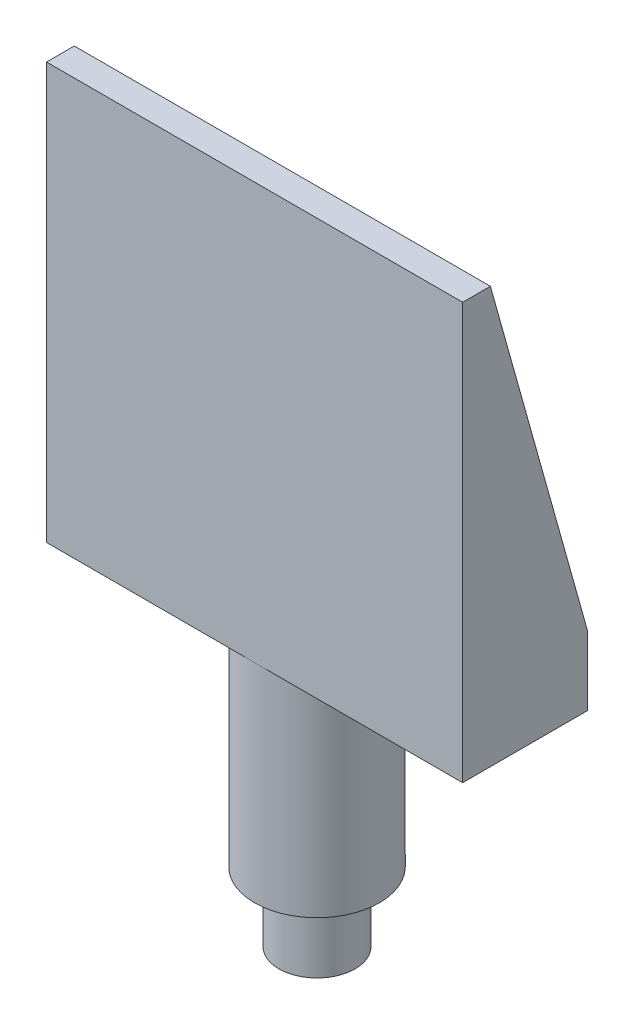
ISO-10303-21;
HEADER;
FILE_DESCRIPTION(('STEP AP214'),'2;1');
FILE_NAME('part.step','',(''),(''),'','','');
FILE_SCHEMA(('AUTOMOTIVE_DESIGN { 1 0 10303 214 1 1 1 1 }'));
ENDSEC;
DATA;
#1=APPLICATION_CONTEXT('core data for automotive mechanical design processes');
#2=APPLICATION_PROTOCOL_DEFINITION('international standard','automotive_design',2000,#1);
#3=PRODUCT_CONTEXT('',#1,'mechanical');
#4=PRODUCT('Part','Part','',(#3));
#5=PRODUCT_RELATED_PRODUCT_CATEGORY('part','',(#4));
#6=PRODUCT_DEFINITION_FORMATION('','',#4);
#7=PRODUCT_DEFINITION_CONTEXT('part definition',#1,'design');
#8=PRODUCT_DEFINITION('design','',#6,#7);
#9=PRODUCT_DEFINITION_SHAPE('','',#8);
#10=(LENGTH_UNIT() NAMED_UNIT(*) SI_UNIT(.MILLI.,.METRE.));
#11=(NAMED_UNIT(*) PLANE_ANGLE_UNIT() SI_UNIT($,.RADIAN.));
#12=(NAMED_UNIT(*) SI_UNIT($,.STERADIAN.) SOLID_ANGLE_UNIT());
#13=UNCERTAINTY_MEASURE_WITH_UNIT(LENGTH_MEASURE(1.E-05),#10,'distance_accuracy_value','');
#14=(GEOMETRIC_REPRESENTATION_CONTEXT(3) GLOBAL_UNCERTAINTY_ASSIGNED_CONTEXT((#13)) GLOBAL_UNIT_ASSIGNED_CONTEXT((#10,
#11,#12)) REPRESENTATION_CONTEXT('',''));
#15=CARTESIAN_POINT('',(0.,0.,0.));
#16=DIRECTION('',(0.,0.,1.));
#17=DIRECTION('',(1.,0.,0.));
#18=AXIS2_PLACEMENT_3D('',#15,#16,#17);
#19=CARTESIAN_POINT('',(0.,5.,0.));
#20=DIRECTION('',(0.,-1.,0.));
#21=DIRECTION('',(0.,0.,-1.));
#22=AXIS2_PLACEMENT_3D('',#19,#20,#21);
#23=CYLINDRICAL_SURFACE('',#22,2.75);
#24=CARTESIAN_POINT('',(0.,5.,0.));
#25=DIRECTION('',(0.,1.,0.));
#26=DIRECTION('',(0.,0.,1.));
#27=AXIS2_PLACEMENT_3D('',#24,#25,#26);
#28=CIRCLE('',#27,2.75);
#29=CARTESIAN_POINT('',(0.,5.,2.75));
#30=VERTEX_POINT('',#29);
#31=EDGE_CURVE('E11',#30,#30,#28,.T.);
#32=ORIENTED_EDGE('',*,*,#31,.F.);
#33=EDGE_LOOP('',(#32));
#34=FACE_BOUND('',#33,.T.);
#35=CARTESIAN_POINT('',(0.,0.,0.));
#36=DIRECTION('',(0.,1.,0.));
#37=DIRECTION('',(0.,0.,1.));
#38=AXIS2_PLACEMENT_3D('',#35,#36,#37);
#39=CIRCLE('',#38,2.75);
#40=CARTESIAN_POINT('',(0.,0.,2.75));
#41=VERTEX_POINT('',#40);
#42=EDGE_CURVE('E42',#41,#41,#39,.T.);
#43=ORIENTED_EDGE('',*,*,#42,.T.);
#44=EDGE_LOOP('',(#43));
#45=FACE_BOUND('',#44,.T.);
#46=ADVANCED_FACE('F39',(#34,#45),#23,.T.);
#47=CARTESIAN_POINT('',(0.,0.,0.));
#48=DIRECTION('',(0.,1.,0.));
#49=DIRECTION('',(0.,0.,1.));
#50=AXIS2_PLACEMENT_3D('',#47,#48,#49);
#51=PLANE('',#50);
#52=ORIENTED_EDGE('',*,*,#42,.F.);
#53=EDGE_LOOP('',(#52));
#54=FACE_BOUND('',#53,.T.);
#55=ADVANCED_FACE('F269',(#54),#51,.F.);
#56=CARTESIAN_POINT('',(0.,20.,0.));
#57=DIRECTION('',(0.,-1.,0.));
#58=DIRECTION('',(0.,0.,-1.));
#59=AXIS2_PLACEMENT_3D('',#56,#57,#58);
#60=CYLINDRICAL_SURFACE('',#59,4.5);
#61=CARTESIAN_POINT('',(0.,20.,0.));
#62=DIRECTION('',(0.,1.,0.));
#63=DIRECTION('',(0.,0.,1.));
#64=AXIS2_PLACEMENT_3D('',#61,#62,#63);
#65=CIRCLE('',#64,4.5);
#66=CARTESIAN_POINT('',(0.,20.,4.5));
#67=VERTEX_POINT('',#66);
#68=CARTESIAN_POINT('',(0.,20.,-4.5));
#69=VERTEX_POINT('',#68);
#70=EDGE_CURVE('E174',#67,#69,#65,.T.);
#71=ORIENTED_EDGE('',*,*,#70,.F.);
#72=EDGE_CURVE('E61',#69,#67,#65,.T.);
#73=ORIENTED_EDGE('',*,*,#72,.F.);
#74=EDGE_LOOP('',(#71,#73));
#75=FACE_BOUND('',#74,.T.);
#76=CARTESIAN_POINT('',(0.,5.,0.));
#77=DIRECTION('',(0.,1.,0.));
#78=DIRECTION('',(0.,0.,1.));
#79=AXIS2_PLACEMENT_3D('',#76,#77,#78);
#80=CIRCLE('',#79,4.5);
#81=CARTESIAN_POINT('',(0.,5.,4.5));
#82=VERTEX_POINT('',#81);
#83=EDGE_CURVE('E173',#82,#82,#80,.T.);
#84=ORIENTED_EDGE('',*,*,#83,.T.);
#85=EDGE_LOOP('',(#84));
#86=FACE_BOUND('',#85,.T.);
#87=ADVANCED_FACE('F274',(#75,#86),#60,.T.);
#88=CARTESIAN_POINT('',(0.,5.,0.));
#89=DIRECTION('',(0.,1.,0.));
#90=DIRECTION('',(0.,0.,1.));
#91=AXIS2_PLACEMENT_3D('',#88,#89,#90);
#92=PLANE('',#91);
#93=ORIENTED_EDGE('',*,*,#31,.T.);
#94=EDGE_LOOP('',(#93));
#95=FACE_BOUND('',#94,.T.);
#96=ORIENTED_EDGE('',*,*,#83,.F.);
#97=EDGE_LOOP('',(#96));
#98=FACE_BOUND('',#97,.T.);
#99=ADVANCED_FACE('F282',(#95,#98),#92,.F.);
#100=CARTESIAN_POINT('',(0.,20.,0.));
#101=DIRECTION('',(0.,1.,0.));
#102=DIRECTION('',(0.,0.,1.));
#103=AXIS2_PLACEMENT_3D('',#100,#101,#102);
#104=PLANE('',#103);
#105=DIRECTION('',(1.,0.,0.));
#106=VECTOR('',#105,1.);
#107=CARTESIAN_POINT('',(15.,20.,4.5));
#108=LINE('',#107,#106);
#109=CARTESIAN_POINT('',(15.,20.,4.5));
#110=VERTEX_POINT('',#109);
#111=EDGE_CURVE('E150',#67,#110,#108,.T.);
#112=ORIENTED_EDGE('',*,*,#111,.F.);
#113=ORIENTED_EDGE('',*,*,#70,.T.);
#114=DIRECTION('',(-1.,0.,0.));
#115=VECTOR('',#114,1.);
#116=CARTESIAN_POINT('',(15.,20.,-4.5));
#117=LINE('',#116,#115);
#118=CARTESIAN_POINT('',(15.,20.,-4.5));
#119=VERTEX_POINT('',#118);
#120=EDGE_CURVE('E160',#119,#69,#117,.T.);
#121=ORIENTED_EDGE('',*,*,#120,.F.);
#122=DIRECTION('',(0.,0.,-1.));
#123=VECTOR('',#122,1.);
#124=CARTESIAN_POINT('',(15.,20.,4.5));
#125=LINE('',#124,#123);
#126=EDGE_CURVE('E156',#110,#119,#125,.T.);
#127=ORIENTED_EDGE('',*,*,#126,.F.);
#128=EDGE_LOOP('',(#112,#113,#121,#127));
#129=FACE_BOUND('',#128,.T.);
#130=ADVANCED_FACE('F190',(#129),#104,.F.);
#131=CARTESIAN_POINT('',(-15.,20.,-4.5));
#132=VERTEX_POINT('',#131);
#133=EDGE_CURVE('E159',#69,#132,#117,.T.);
#134=ORIENTED_EDGE('',*,*,#133,.F.);
#135=ORIENTED_EDGE('',*,*,#72,.T.);
#136=CARTESIAN_POINT('',(-15.,20.,4.5));
#137=VERTEX_POINT('',#136);
#138=EDGE_CURVE('E152',#137,#67,#108,.T.);
#139=ORIENTED_EDGE('',*,*,#138,.F.);
#140=DIRECTION('',(0.,0.,1.));
#141=VECTOR('',#140,1.);
#142=CARTESIAN_POINT('',(-15.,20.,4.5));
#143=LINE('',#142,#141);
#144=EDGE_CURVE('E146',#132,#137,#143,.T.);
#145=ORIENTED_EDGE('',*,*,#144,.F.);
#146=EDGE_LOOP('',(#134,#135,#139,#145));
#147=FACE_BOUND('',#146,.T.);
#148=ADVANCED_FACE('F185',(#147),#104,.F.);
#149=CARTESIAN_POINT('',(-15.,50.,4.5));
#150=DIRECTION('',(1.,0.,0.));
#151=DIRECTION('',(0.,0.,-1.));
#152=AXIS2_PLACEMENT_3D('',#149,#150,#151);
#153=PLANE('',#152);
#154=DIRECTION('',(0.,0.,1.));
#155=VECTOR('',#154,1.);
#156=CARTESIAN_POINT('',(-15.,50.,4.5));
#157=LINE('',#156,#155);
#158=CARTESIAN_POINT('',(-15.,50.,2.5));
#159=VERTEX_POINT('',#158);
#160=CARTESIAN_POINT('',(-15.,50.,4.5));
#161=VERTEX_POINT('',#160);
#162=EDGE_CURVE('E142',#159,#161,#157,.T.);
#163=ORIENTED_EDGE('',*,*,#162,.F.);
#164=DIRECTION('',(0.,-0.962964019714182,-0.269629925519971));
#165=VECTOR('',#164,1.);
#166=CARTESIAN_POINT('',(-15.,50.5192878338279,2.64540059347181));
#167=LINE('',#166,#165);
#168=CARTESIAN_POINT('',(-15.,25.,-4.5));
#169=VERTEX_POINT('',#168);
#170=EDGE_CURVE('E201',#159,#169,#167,.T.);
#171=ORIENTED_EDGE('',*,*,#170,.T.);
#172=DIRECTION('',(0.,-1.,0.));
#173=VECTOR('',#172,1.);
#174=CARTESIAN_POINT('',(-15.,50.,-4.5));
#175=LINE('',#174,#173);
#176=EDGE_CURVE('E137',#169,#132,#175,.T.);
#177=ORIENTED_EDGE('',*,*,#176,.T.);
#178=ORIENTED_EDGE('',*,*,#144,.T.);
#179=DIRECTION('',(0.,-1.,0.));
#180=VECTOR('',#179,1.);
#181=CARTESIAN_POINT('',(-15.,50.,4.5));
#182=LINE('',#181,#180);
#183=EDGE_CURVE('E169',#161,#137,#182,.T.);
#184=ORIENTED_EDGE('',*,*,#183,.F.);
#185=EDGE_LOOP('',(#163,#171,#177,#178,#184));
#186=FACE_BOUND('',#185,.T.);
#187=ADVANCED_FACE('F198',(#186),#153,.F.);
#188=CARTESIAN_POINT('',(15.,50.,4.5));
#189=DIRECTION('',(0.,0.,-1.));
#190=DIRECTION('',(-1.,0.,0.));
#191=AXIS2_PLACEMENT_3D('',#188,#189,#190);
#192=PLANE('',#191);
#193=ORIENTED_EDGE('',*,*,#138,.T.);
#194=ORIENTED_EDGE('',*,*,#111,.T.);
#195=DIRECTION('',(0.,-1.,0.));
#196=VECTOR('',#195,1.);
#197=CARTESIAN_POINT('',(15.,50.,4.5));
#198=LINE('',#197,#196);
#199=CARTESIAN_POINT('',(15.,50.,4.5));
#200=VERTEX_POINT('',#199);
#201=EDGE_CURVE('E166',#200,#110,#198,.T.);
#202=ORIENTED_EDGE('',*,*,#201,.F.);
#203=DIRECTION('',(1.,0.,0.));
#204=VECTOR('',#203,1.);
#205=CARTESIAN_POINT('',(15.,50.,4.5));
#206=LINE('',#205,#204);
#207=EDGE_CURVE('E134',#161,#200,#206,.T.);
#208=ORIENTED_EDGE('',*,*,#207,.F.);
#209=ORIENTED_EDGE('',*,*,#183,.T.);
#210=EDGE_LOOP('',(#193,#194,#202,#208,#209));
#211=FACE_BOUND('',#210,.T.);
#212=ADVANCED_FACE('F194',(#211),#192,.F.);
#213=CARTESIAN_POINT('',(15.,50.,4.5));
#214=DIRECTION('',(-1.,0.,0.));
#215=DIRECTION('',(0.,0.,1.));
#216=AXIS2_PLACEMENT_3D('',#213,#214,#215);
#217=PLANE('',#216);
#218=DIRECTION('',(0.,-1.,0.));
#219=VECTOR('',#218,1.);
#220=CARTESIAN_POINT('',(15.,50.,-4.5));
#221=LINE('',#220,#219);
#222=CARTESIAN_POINT('',(15.,25.,-4.5));
#223=VERTEX_POINT('',#222);
#224=EDGE_CURVE('E129',#223,#119,#221,.T.);
#225=ORIENTED_EDGE('',*,*,#224,.F.);
#226=DIRECTION('',(0.,-0.962964019714182,-0.269629925519971));
#227=VECTOR('',#226,1.);
#228=CARTESIAN_POINT('',(15.,50.,2.5));
#229=LINE('',#228,#227);
#230=CARTESIAN_POINT('',(15.,50.,2.5));
#231=VERTEX_POINT('',#230);
#232=EDGE_CURVE('E112',#231,#223,#229,.T.);
#233=ORIENTED_EDGE('',*,*,#232,.F.);
#234=DIRECTION('',(0.,0.,-1.));
#235=VECTOR('',#234,1.);
#236=CARTESIAN_POINT('',(15.,50.,4.5));
#237=LINE('',#236,#235);
#238=EDGE_CURVE('E127',#200,#231,#237,.T.);
#239=ORIENTED_EDGE('',*,*,#238,.F.);
#240=ORIENTED_EDGE('',*,*,#201,.T.);
#241=ORIENTED_EDGE('',*,*,#126,.T.);
#242=EDGE_LOOP('',(#225,#233,#239,#240,#241));
#243=FACE_BOUND('',#242,.T.);
#244=ADVANCED_FACE('F125',(#243),#217,.F.);
#245=CARTESIAN_POINT('',(15.,50.,-4.5));
#246=DIRECTION('',(0.,0.,1.));
#247=DIRECTION('',(1.,0.,0.));
#248=AXIS2_PLACEMENT_3D('',#245,#246,#247);
#249=PLANE('',#248);
#250=ORIENTED_EDGE('',*,*,#176,.F.);
#251=DIRECTION('',(1.,0.,0.));
#252=VECTOR('',#251,1.);
#253=CARTESIAN_POINT('',(-24.,25.,-4.5));
#254=LINE('',#253,#252);
#255=CARTESIAN_POINT('',(-13.,25.,-4.5));
#256=VERTEX_POINT('',#255);
#257=EDGE_CURVE('E240',#169,#256,#254,.T.);
#258=ORIENTED_EDGE('',*,*,#257,.T.);
#259=DIRECTION('',(-1.,0.,0.));
#260=VECTOR('',#259,1.);
#261=CARTESIAN_POINT('',(-13.,25.,-4.5));
#262=LINE('',#261,#260);
#263=CARTESIAN_POINT('',(13.,25.,-4.5));
#264=VERTEX_POINT('',#263);
#265=EDGE_CURVE('E213',#264,#256,#262,.T.);
#266=ORIENTED_EDGE('',*,*,#265,.F.);
#267=EDGE_CURVE('E243',#264,#223,#254,.T.);
#268=ORIENTED_EDGE('',*,*,#267,.T.);
#269=ORIENTED_EDGE('',*,*,#224,.T.);
#270=ORIENTED_EDGE('',*,*,#120,.T.);
#271=ORIENTED_EDGE('',*,*,#133,.T.);
#272=EDGE_LOOP('',(#250,#258,#266,#268,#269,#270,#271));
#273=FACE_BOUND('',#272,.T.);
#274=ADVANCED_FACE('F204',(#273),#249,.F.);
#275=CARTESIAN_POINT('',(0.,50.,0.));
#276=DIRECTION('',(0.,1.,0.));
#277=DIRECTION('',(0.,0.,1.));
#278=AXIS2_PLACEMENT_3D('',#275,#276,#277);
#279=PLANE('',#278);
#280=DIRECTION('',(1.,0.,0.));
#281=VECTOR('',#280,1.);
#282=CARTESIAN_POINT('',(-24.,50.,2.5));
#283=LINE('',#282,#281);
#284=CARTESIAN_POINT('',(-13.,50.,2.5));
#285=VERTEX_POINT('',#284);
#286=EDGE_CURVE('E54',#159,#285,#283,.T.);
#287=ORIENTED_EDGE('',*,*,#286,.F.);
#288=ORIENTED_EDGE('',*,*,#162,.T.);
#289=ORIENTED_EDGE('',*,*,#207,.T.);
#290=ORIENTED_EDGE('',*,*,#238,.T.);
#291=CARTESIAN_POINT('',(13.,50.,2.5));
#292=VERTEX_POINT('',#291);
#293=EDGE_CURVE('E109',#292,#231,#283,.T.);
#294=ORIENTED_EDGE('',*,*,#293,.F.);
#295=DIRECTION('',(1.,0.,0.));
#296=VECTOR('',#295,1.);
#297=CARTESIAN_POINT('',(-13.,50.,2.5));
#298=LINE('',#297,#296);
#299=EDGE_CURVE('E229',#285,#292,#298,.T.);
#300=ORIENTED_EDGE('',*,*,#299,.F.);
#301=EDGE_LOOP('',(#287,#288,#289,#290,#294,#300));
#302=FACE_BOUND('',#301,.T.);
#303=ADVANCED_FACE('F132',(#302),#279,.T.);
#304=CARTESIAN_POINT('',(-13.,25.,-4.5));
#305=DIRECTION('',(-1.,0.,0.));
#306=DIRECTION('',(0.,0.,1.));
#307=AXIS2_PLACEMENT_3D('',#304,#305,#306);
#308=PLANE('',#307);
#309=DIRECTION('',(0.,0.,1.));
#310=VECTOR('',#309,1.);
#311=CARTESIAN_POINT('',(-13.,25.,-4.5));
#312=LINE('',#311,#310);
#313=CARTESIAN_POINT('',(-13.,25.,2.5));
#314=VERTEX_POINT('',#313);
#315=EDGE_CURVE('E225',#256,#314,#312,.T.);
#316=ORIENTED_EDGE('',*,*,#315,.F.);
#317=DIRECTION('',(0.,0.962964019714182,0.269629925519971));
#318=VECTOR('',#317,1.);
#319=CARTESIAN_POINT('',(-13.,25.,-4.5));
#320=LINE('',#319,#318);
#321=EDGE_CURVE('E235',#256,#285,#320,.T.);
#322=ORIENTED_EDGE('',*,*,#321,.T.);
#323=DIRECTION('',(0.,1.,0.));
#324=VECTOR('',#323,1.);
#325=CARTESIAN_POINT('',(-13.,25.,2.5));
#326=LINE('',#325,#324);
#327=EDGE_CURVE('E209',#314,#285,#326,.T.);
#328=ORIENTED_EDGE('',*,*,#327,.F.);
#329=EDGE_LOOP('',(#316,#322,#328));
#330=FACE_BOUND('',#329,.T.);
#331=ADVANCED_FACE('F252',(#330),#308,.F.);
#332=CARTESIAN_POINT('',(13.,25.,-4.5));
#333=DIRECTION('',(1.,0.,0.));
#334=DIRECTION('',(0.,0.,-1.));
#335=AXIS2_PLACEMENT_3D('',#332,#333,#334);
#336=PLANE('',#335);
#337=DIRECTION('',(0.,1.,0.));
#338=VECTOR('',#337,1.);
#339=CARTESIAN_POINT('',(13.,25.,2.5));
#340=LINE('',#339,#338);
#341=CARTESIAN_POINT('',(13.,25.,2.5));
#342=VERTEX_POINT('',#341);
#343=EDGE_CURVE('E151',#342,#292,#340,.T.);
#344=ORIENTED_EDGE('',*,*,#343,.T.);
#345=DIRECTION('',(0.,-0.962964019714182,-0.269629925519971));
#346=VECTOR('',#345,1.);
#347=CARTESIAN_POINT('',(13.,25.,-4.5));
#348=LINE('',#347,#346);
#349=EDGE_CURVE('E115',#292,#264,#348,.T.);
#350=ORIENTED_EDGE('',*,*,#349,.T.);
#351=DIRECTION('',(0.,0.,-1.));
#352=VECTOR('',#351,1.);
#353=CARTESIAN_POINT('',(13.,25.,-4.5));
#354=LINE('',#353,#352);
#355=EDGE_CURVE('E217',#342,#264,#354,.T.);
#356=ORIENTED_EDGE('',*,*,#355,.F.);
#357=EDGE_LOOP('',(#344,#350,#356));
#358=FACE_BOUND('',#357,.T.);
#359=ADVANCED_FACE('F258',(#358),#336,.F.);
#360=CARTESIAN_POINT('',(-13.,25.,2.5));
#361=DIRECTION('',(0.,0.,1.));
#362=DIRECTION('',(1.,0.,0.));
#363=AXIS2_PLACEMENT_3D('',#360,#361,#362);
#364=PLANE('',#363);
#365=ORIENTED_EDGE('',*,*,#299,.T.);
#366=ORIENTED_EDGE('',*,*,#343,.F.);
#367=DIRECTION('',(1.,0.,0.));
#368=VECTOR('',#367,1.);
#369=CARTESIAN_POINT('',(-13.,25.,2.5));
#370=LINE('',#369,#368);
#371=EDGE_CURVE('E221',#314,#342,#370,.T.);
#372=ORIENTED_EDGE('',*,*,#371,.F.);
#373=ORIENTED_EDGE('',*,*,#327,.T.);
#374=EDGE_LOOP('',(#365,#366,#372,#373));
#375=FACE_BOUND('',#374,.T.);
#376=ADVANCED_FACE('F247',(#375),#364,.F.);
#377=CARTESIAN_POINT('',(0.,25.,0.));
#378=DIRECTION('',(0.,1.,0.));
#379=DIRECTION('',(0.,0.,1.));
#380=AXIS2_PLACEMENT_3D('',#377,#378,#379);
#381=PLANE('',#380);
#382=ORIENTED_EDGE('',*,*,#315,.T.);
#383=ORIENTED_EDGE('',*,*,#371,.T.);
#384=ORIENTED_EDGE('',*,*,#355,.T.);
#385=ORIENTED_EDGE('',*,*,#265,.T.);
#386=EDGE_LOOP('',(#382,#383,#384,#385));
#387=FACE_BOUND('',#386,.T.);
#388=ADVANCED_FACE('F256',(#387),#381,.T.);
#389=CARTESIAN_POINT('',(-24.,50.,2.5));
#390=DIRECTION('',(0.,-0.269629925519971,0.962964019714182));
#391=DIRECTION('',(0.,-0.962964019714182,-0.269629925519971));
#392=AXIS2_PLACEMENT_3D('',#389,#390,#391);
#393=PLANE('',#392);
#394=ORIENTED_EDGE('',*,*,#293,.T.);
#395=ORIENTED_EDGE('',*,*,#232,.T.);
#396=ORIENTED_EDGE('',*,*,#267,.F.);
#397=ORIENTED_EDGE('',*,*,#349,.F.);
#398=EDGE_LOOP('',(#394,#395,#396,#397));
#399=FACE_BOUND('',#398,.T.);
#400=ADVANCED_FACE('F111',(#399),#393,.F.);
#401=ORIENTED_EDGE('',*,*,#286,.T.);
#402=ORIENTED_EDGE('',*,*,#321,.F.);
#403=ORIENTED_EDGE('',*,*,#257,.F.);
#404=ORIENTED_EDGE('',*,*,#170,.F.);
#405=EDGE_LOOP('',(#401,#402,#403,#404));
#406=FACE_BOUND('',#405,.T.);
#407=ADVANCED_FACE('F253',(#406),#393,.F.);
#408=CLOSED_SHELL('',(#46,#55,#87,#99,#130,#148,#187,#212,#244,#274,#303,#331,#359,#376,#388,
#400,#407));
#409=MANIFOLD_SOLID_BREP('B2',#408);
#410=ADVANCED_BREP_SHAPE_REPRESENTATION('',(#18,#409),#14);
#411=SHAPE_DEFINITION_REPRESENTATION(#9,#410);
ENDSEC;
END-ISO-10303-21;
